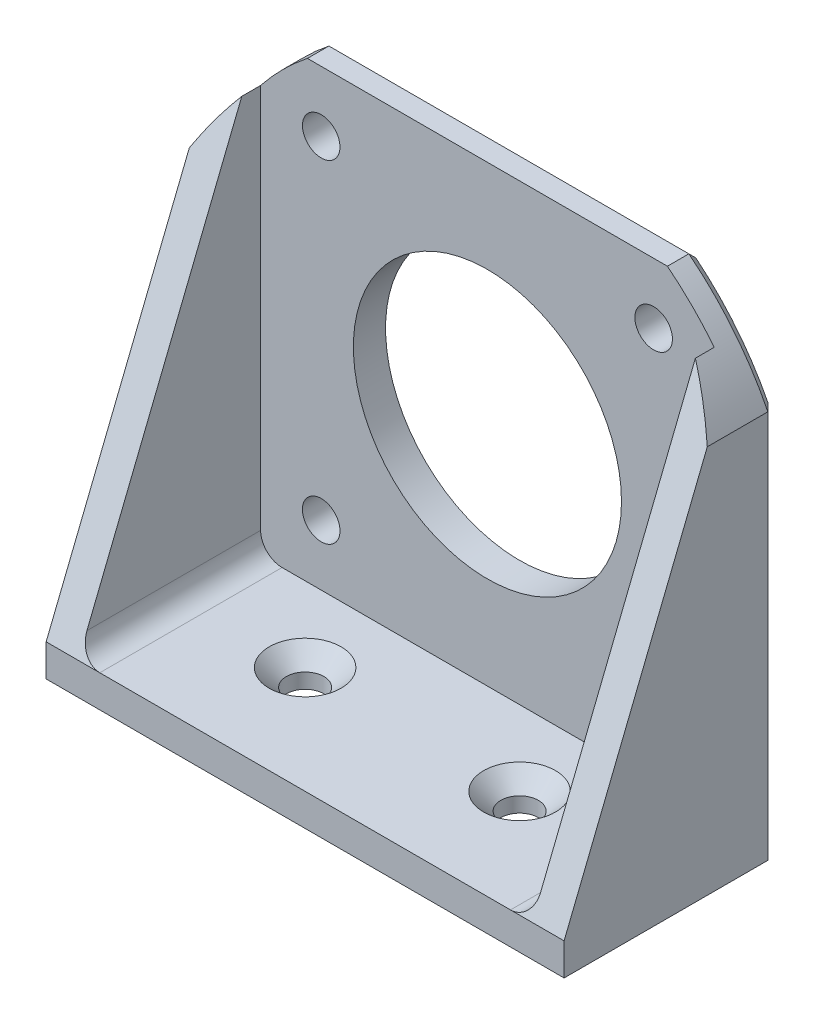
ISO-10303-21;
HEADER;
FILE_DESCRIPTION(('STEP AP214'),'2;1');
FILE_NAME('part.step','',(''),(''),'','','');
FILE_SCHEMA(('AUTOMOTIVE_DESIGN { 1 0 10303 214 1 1 1 1 }'));
ENDSEC;
DATA;
#1=APPLICATION_CONTEXT('core data for automotive mechanical design processes');
#2=APPLICATION_PROTOCOL_DEFINITION('international standard','automotive_design',2000,#1);
#3=PRODUCT_CONTEXT('',#1,'mechanical');
#4=PRODUCT('Part','Part','',(#3));
#5=PRODUCT_RELATED_PRODUCT_CATEGORY('part','',(#4));
#6=PRODUCT_DEFINITION_FORMATION('','',#4);
#7=PRODUCT_DEFINITION_CONTEXT('part definition',#1,'design');
#8=PRODUCT_DEFINITION('design','',#6,#7);
#9=PRODUCT_DEFINITION_SHAPE('','',#8);
#10=(LENGTH_UNIT() NAMED_UNIT(*) SI_UNIT(.MILLI.,.METRE.));
#11=(NAMED_UNIT(*) PLANE_ANGLE_UNIT() SI_UNIT($,.RADIAN.));
#12=(NAMED_UNIT(*) SI_UNIT($,.STERADIAN.) SOLID_ANGLE_UNIT());
#13=UNCERTAINTY_MEASURE_WITH_UNIT(LENGTH_MEASURE(1.E-05),#10,'distance_accuracy_value','');
#14=(GEOMETRIC_REPRESENTATION_CONTEXT(3) GLOBAL_UNCERTAINTY_ASSIGNED_CONTEXT((#13)) GLOBAL_UNIT_ASSIGNED_CONTEXT((#10,
#11,#12)) REPRESENTATION_CONTEXT('',''));
#15=CARTESIAN_POINT('',(0.,0.,0.));
#16=DIRECTION('',(0.,0.,1.));
#17=DIRECTION('',(1.,0.,0.));
#18=AXIS2_PLACEMENT_3D('',#15,#16,#17);
#19=CARTESIAN_POINT('',(-24.15,45.3,-7.00000000000001));
#20=DIRECTION('',(0.,0.,-1.));
#21=DIRECTION('',(-1.,0.,0.));
#22=AXIS2_PLACEMENT_3D('',#19,#20,#21);
#23=PLANE('',#22);
#24=CARTESIAN_POINT('',(-15.5,8.64999999999999,-7.));
#25=DIRECTION('',(0.,0.,1.));
#26=DIRECTION('',(1.,0.,0.));
#27=AXIS2_PLACEMENT_3D('',#24,#25,#26);
#28=CIRCLE('',#27,1.75);
#29=CARTESIAN_POINT('',(-13.75,8.64999999999999,-7.));
#30=VERTEX_POINT('',#29);
#31=EDGE_CURVE('E197',#30,#30,#28,.T.);
#32=ORIENTED_EDGE('',*,*,#31,.F.);
#33=EDGE_LOOP('',(#32));
#34=FACE_BOUND('',#33,.T.);
#35=CARTESIAN_POINT('',(15.5,8.64999999999999,-7.));
#36=DIRECTION('',(0.,0.,1.));
#37=DIRECTION('',(1.,0.,0.));
#38=AXIS2_PLACEMENT_3D('',#35,#36,#37);
#39=CIRCLE('',#38,1.75);
#40=CARTESIAN_POINT('',(17.25,8.64999999999999,-7.));
#41=VERTEX_POINT('',#40);
#42=EDGE_CURVE('E214',#41,#41,#39,.T.);
#43=ORIENTED_EDGE('',*,*,#42,.F.);
#44=EDGE_LOOP('',(#43));
#45=FACE_BOUND('',#44,.T.);
#46=CARTESIAN_POINT('',(15.5,39.65,-7.));
#47=DIRECTION('',(0.,0.,1.));
#48=DIRECTION('',(1.,0.,0.));
#49=AXIS2_PLACEMENT_3D('',#46,#47,#48);
#50=CIRCLE('',#49,1.75);
#51=CARTESIAN_POINT('',(17.25,39.65,-7.));
#52=VERTEX_POINT('',#51);
#53=EDGE_CURVE('E208',#52,#52,#50,.T.);
#54=ORIENTED_EDGE('',*,*,#53,.F.);
#55=EDGE_LOOP('',(#54));
#56=FACE_BOUND('',#55,.T.);
#57=CARTESIAN_POINT('',(-15.5,39.65,-7.));
#58=DIRECTION('',(0.,0.,1.));
#59=DIRECTION('',(1.,0.,0.));
#60=AXIS2_PLACEMENT_3D('',#57,#58,#59);
#61=CIRCLE('',#60,1.75);
#62=CARTESIAN_POINT('',(-13.75,39.65,-7.));
#63=VERTEX_POINT('',#62);
#64=EDGE_CURVE('E202',#63,#63,#61,.T.);
#65=ORIENTED_EDGE('',*,*,#64,.F.);
#66=EDGE_LOOP('',(#65));
#67=FACE_BOUND('',#66,.T.);
#68=CARTESIAN_POINT('',(0.,24.15,-7.));
#69=DIRECTION('',(0.,0.,1.));
#70=DIRECTION('',(1.,0.,0.));
#71=AXIS2_PLACEMENT_3D('',#68,#69,#70);
#72=CIRCLE('',#71,12.5);
#73=CARTESIAN_POINT('',(12.5,24.15,-7.));
#74=VERTEX_POINT('',#73);
#75=EDGE_CURVE('E201',#74,#74,#72,.T.);
#76=ORIENTED_EDGE('',*,*,#75,.F.);
#77=EDGE_LOOP('',(#76));
#78=FACE_BOUND('',#77,.T.);
#79=DIRECTION('',(1.,0.,0.));
#80=VECTOR('',#79,1.);
#81=CARTESIAN_POINT('',(-24.15,3.,-7.00000000000001));
#82=LINE('',#81,#80);
#83=CARTESIAN_POINT('',(-19.15,3.,-7.00000000000001));
#84=VERTEX_POINT('',#83);
#85=CARTESIAN_POINT('',(19.15,3.,-7.));
#86=VERTEX_POINT('',#85);
#87=EDGE_CURVE('E225',#84,#86,#82,.T.);
#88=ORIENTED_EDGE('',*,*,#87,.T.);
#89=CARTESIAN_POINT('',(19.15,5.,-7.));
#90=DIRECTION('',(0.,0.,-1.));
#91=DIRECTION('',(-1.,0.,0.));
#92=AXIS2_PLACEMENT_3D('',#89,#90,#91);
#93=CIRCLE('',#92,2.);
#94=CARTESIAN_POINT('',(21.15,5.,-7.));
#95=VERTEX_POINT('',#94);
#96=EDGE_CURVE('E255',#86,#95,#93,.F.);
#97=ORIENTED_EDGE('',*,*,#96,.T.);
#98=DIRECTION('',(0.,-1.,0.));
#99=VECTOR('',#98,1.);
#100=CARTESIAN_POINT('',(21.15,45.3,-7.));
#101=LINE('',#100,#99);
#102=CARTESIAN_POINT('',(21.15,40.9332505790743,-7.));
#103=VERTEX_POINT('',#102);
#104=EDGE_CURVE('E182',#103,#95,#101,.T.);
#105=ORIENTED_EDGE('',*,*,#104,.F.);
#106=CARTESIAN_POINT('',(0.,24.15,-7.00000000000001));
#107=DIRECTION('',(0.,0.,-1.));
#108=DIRECTION('',(-1.,0.,0.));
#109=AXIS2_PLACEMENT_3D('',#106,#107,#108);
#110=CIRCLE('',#109,27.);
#111=CARTESIAN_POINT('',(16.7832505790744,45.3,-7.00000000000001));
#112=VERTEX_POINT('',#111);
#113=EDGE_CURVE('E158',#103,#112,#110,.F.);
#114=ORIENTED_EDGE('',*,*,#113,.T.);
#115=DIRECTION('',(1.,0.,0.));
#116=VECTOR('',#115,1.);
#117=CARTESIAN_POINT('',(-24.15,45.3,-7.00000000000001));
#118=LINE('',#117,#116);
#119=CARTESIAN_POINT('',(-16.7832505790744,45.3,-7.00000000000001));
#120=VERTEX_POINT('',#119);
#121=EDGE_CURVE('E228',#120,#112,#118,.T.);
#122=ORIENTED_EDGE('',*,*,#121,.F.);
#123=CARTESIAN_POINT('',(-21.15,40.9332505790744,-7.));
#124=VERTEX_POINT('',#123);
#125=EDGE_CURVE('E184',#120,#124,#110,.F.);
#126=ORIENTED_EDGE('',*,*,#125,.T.);
#127=DIRECTION('',(0.,1.,0.));
#128=VECTOR('',#127,1.);
#129=CARTESIAN_POINT('',(-21.15,45.3,-7.00000000000001));
#130=LINE('',#129,#128);
#131=CARTESIAN_POINT('',(-21.15,5.,-7.00000000000001));
#132=VERTEX_POINT('',#131);
#133=EDGE_CURVE('E193',#132,#124,#130,.T.);
#134=ORIENTED_EDGE('',*,*,#133,.F.);
#135=CARTESIAN_POINT('',(-19.15,5.,-7.00000000000001));
#136=DIRECTION('',(0.,0.,-1.));
#137=DIRECTION('',(-1.,0.,0.));
#138=AXIS2_PLACEMENT_3D('',#135,#136,#137);
#139=CIRCLE('',#138,2.);
#140=EDGE_CURVE('E253',#132,#84,#139,.F.);
#141=ORIENTED_EDGE('',*,*,#140,.T.);
#142=EDGE_LOOP('',(#88,#97,#105,#114,#122,#126,#134,#141));
#143=FACE_BOUND('',#142,.T.);
#144=ADVANCED_FACE('F35',(#34,#45,#56,#67,#78,#143),#23,.F.);
#145=CARTESIAN_POINT('',(0.,3.,0.));
#146=DIRECTION('',(0.,1.,0.));
#147=DIRECTION('',(0.,0.,1.));
#148=AXIS2_PLACEMENT_3D('',#145,#146,#147);
#149=PLANE('',#148);
#150=CARTESIAN_POINT('',(10.,3.,0.));
#151=DIRECTION('',(0.,1.,0.));
#152=DIRECTION('',(0.,0.,1.));
#153=AXIS2_PLACEMENT_3D('',#150,#151,#152);
#154=CIRCLE('',#153,3.35000000000001);
#155=CARTESIAN_POINT('',(10.,3.,3.35000000000001));
#156=VERTEX_POINT('',#155);
#157=EDGE_CURVE('E44',#156,#156,#154,.F.);
#158=ORIENTED_EDGE('',*,*,#157,.T.);
#159=EDGE_LOOP('',(#158));
#160=FACE_BOUND('',#159,.T.);
#161=CARTESIAN_POINT('',(-10.,3.,0.));
#162=DIRECTION('',(0.,1.,0.));
#163=DIRECTION('',(0.,0.,1.));
#164=AXIS2_PLACEMENT_3D('',#161,#162,#163);
#165=CIRCLE('',#164,3.35000000000001);
#166=CARTESIAN_POINT('',(-10.,3.,3.35000000000001));
#167=VERTEX_POINT('',#166);
#168=EDGE_CURVE('E731',#167,#167,#165,.F.);
#169=ORIENTED_EDGE('',*,*,#168,.T.);
#170=EDGE_LOOP('',(#169));
#171=FACE_BOUND('',#170,.T.);
#172=DIRECTION('',(1.,0.,0.));
#173=VECTOR('',#172,1.);
#174=CARTESIAN_POINT('',(-24.15,3.,9.99999999999999));
#175=LINE('',#174,#173);
#176=CARTESIAN_POINT('',(-19.15,3.,9.99999999999999));
#177=VERTEX_POINT('',#176);
#178=CARTESIAN_POINT('',(19.15,3.,9.99999999999999));
#179=VERTEX_POINT('',#178);
#180=EDGE_CURVE('E237',#177,#179,#175,.T.);
#181=ORIENTED_EDGE('',*,*,#180,.T.);
#182=DIRECTION('',(0.,0.,-1.));
#183=VECTOR('',#182,1.);
#184=CARTESIAN_POINT('',(19.15,3.,0.));
#185=LINE('',#184,#183);
#186=EDGE_CURVE('E250',#179,#86,#185,.T.);
#187=ORIENTED_EDGE('',*,*,#186,.T.);
#188=ORIENTED_EDGE('',*,*,#87,.F.);
#189=DIRECTION('',(0.,0.,1.));
#190=VECTOR('',#189,1.);
#191=CARTESIAN_POINT('',(-19.15,3.,0.));
#192=LINE('',#191,#190);
#193=EDGE_CURVE('E163',#84,#177,#192,.T.);
#194=ORIENTED_EDGE('',*,*,#193,.T.);
#195=EDGE_LOOP('',(#181,#187,#188,#194));
#196=FACE_BOUND('',#195,.T.);
#197=ADVANCED_FACE('F368',(#160,#171,#196),#149,.T.);
#198=CARTESIAN_POINT('',(24.15,3.,-10.));
#199=DIRECTION('',(-1.,0.,0.));
#200=DIRECTION('',(0.,0.,1.));
#201=AXIS2_PLACEMENT_3D('',#198,#199,#200);
#202=PLANE('',#201);
#203=DIRECTION('',(0.,0.,-1.));
#204=VECTOR('',#203,1.);
#205=CARTESIAN_POINT('',(24.15,0.,-10.));
#206=LINE('',#205,#204);
#207=CARTESIAN_POINT('',(24.15,0.,9.99999999999999));
#208=VERTEX_POINT('',#207);
#209=CARTESIAN_POINT('',(24.15,0.,-9.00000000000001));
#210=VERTEX_POINT('',#209);
#211=EDGE_CURVE('E231',#208,#210,#206,.T.);
#212=ORIENTED_EDGE('',*,*,#211,.T.);
#213=DIRECTION('',(0.,1.,0.));
#214=VECTOR('',#213,1.);
#215=CARTESIAN_POINT('',(24.15,3.,-9.00000000000001));
#216=LINE('',#215,#214);
#217=CARTESIAN_POINT('',(24.15,36.2238353475604,-9.00000000000001));
#218=VERTEX_POINT('',#217);
#219=EDGE_CURVE('E280',#210,#218,#216,.T.);
#220=ORIENTED_EDGE('',*,*,#219,.T.);
#221=DIRECTION('',(0.,0.,-1.));
#222=VECTOR('',#221,1.);
#223=CARTESIAN_POINT('',(24.15,36.2238353475604,9.99999999999999));
#224=LINE('',#223,#222);
#225=CARTESIAN_POINT('',(24.15,36.2238353475604,-3.35236881580443));
#226=VERTEX_POINT('',#225);
#227=EDGE_CURVE('E174',#218,#226,#224,.F.);
#228=ORIENTED_EDGE('',*,*,#227,.T.);
#229=DIRECTION('',(0.,-0.927870342081396,0.372902974358953));
#230=VECTOR('',#229,1.);
#231=CARTESIAN_POINT('',(24.15,45.3,-7.00000000000001));
#232=LINE('',#231,#230);
#233=CARTESIAN_POINT('',(24.15,3.00000000000002,9.99999999999999));
#234=VERTEX_POINT('',#233);
#235=EDGE_CURVE('E173',#226,#234,#232,.T.);
#236=ORIENTED_EDGE('',*,*,#235,.T.);
#237=DIRECTION('',(0.,-1.,0.));
#238=VECTOR('',#237,1.);
#239=CARTESIAN_POINT('',(24.15,3.,9.99999999999999));
#240=LINE('',#239,#238);
#241=EDGE_CURVE('E236',#234,#208,#240,.T.);
#242=ORIENTED_EDGE('',*,*,#241,.T.);
#243=EDGE_LOOP('',(#212,#220,#228,#236,#242));
#244=FACE_BOUND('',#243,.T.);
#245=ADVANCED_FACE('F375',(#244),#202,.F.);
#246=CARTESIAN_POINT('',(-24.15,3.,-10.));
#247=DIRECTION('',(0.,0.,1.));
#248=DIRECTION('',(1.,0.,0.));
#249=AXIS2_PLACEMENT_3D('',#246,#247,#248);
#250=PLANE('',#249);
#251=DIRECTION('',(0.,-1.,0.));
#252=VECTOR('',#251,1.);
#253=CARTESIAN_POINT('',(23.15,3.,-10.));
#254=LINE('',#253,#252);
#255=CARTESIAN_POINT('',(23.15,35.9854340858289,-10.));
#256=VERTEX_POINT('',#255);
#257=CARTESIAN_POINT('',(23.15,1.00000000000001,-10.));
#258=VERTEX_POINT('',#257);
#259=EDGE_CURVE('E272',#256,#258,#254,.T.);
#260=ORIENTED_EDGE('',*,*,#259,.T.);
#261=DIRECTION('',(-1.,0.,0.));
#262=VECTOR('',#261,1.);
#263=CARTESIAN_POINT('',(-24.15,1.00000000000001,-10.));
#264=LINE('',#263,#262);
#265=CARTESIAN_POINT('',(-23.15,1.00000000000001,-10.));
#266=VERTEX_POINT('',#265);
#267=EDGE_CURVE('E274',#258,#266,#264,.T.);
#268=ORIENTED_EDGE('',*,*,#267,.T.);
#269=DIRECTION('',(0.,1.,0.));
#270=VECTOR('',#269,1.);
#271=CARTESIAN_POINT('',(-23.15,3.,-10.));
#272=LINE('',#271,#270);
#273=CARTESIAN_POINT('',(-23.15,35.9854340858289,-10.));
#274=VERTEX_POINT('',#273);
#275=EDGE_CURVE('E264',#266,#274,#272,.T.);
#276=ORIENTED_EDGE('',*,*,#275,.T.);
#277=CARTESIAN_POINT('',(0.,24.15,-10.));
#278=DIRECTION('',(0.,0.,1.));
#279=DIRECTION('',(1.,0.,0.));
#280=AXIS2_PLACEMENT_3D('',#277,#278,#279);
#281=CIRCLE('',#280,26.);
#282=CARTESIAN_POINT('',(-16.4309920576939,44.3,-10.));
#283=VERTEX_POINT('',#282);
#284=EDGE_CURVE('E266',#274,#283,#281,.F.);
#285=ORIENTED_EDGE('',*,*,#284,.T.);
#286=DIRECTION('',(1.,0.,0.));
#287=VECTOR('',#286,1.);
#288=CARTESIAN_POINT('',(16.7832505790744,44.3,-10.));
#289=LINE('',#288,#287);
#290=CARTESIAN_POINT('',(16.4309920576939,44.3,-10.));
#291=VERTEX_POINT('',#290);
#292=EDGE_CURVE('E268',#283,#291,#289,.T.);
#293=ORIENTED_EDGE('',*,*,#292,.T.);
#294=CARTESIAN_POINT('',(0.,24.15,-10.));
#295=DIRECTION('',(0.,0.,1.));
#296=DIRECTION('',(1.,0.,0.));
#297=AXIS2_PLACEMENT_3D('',#294,#295,#296);
#298=CIRCLE('',#297,26.);
#299=EDGE_CURVE('E270',#291,#256,#298,.F.);
#300=ORIENTED_EDGE('',*,*,#299,.T.);
#301=EDGE_LOOP('',(#260,#268,#276,#285,#293,#300));
#302=FACE_BOUND('',#301,.T.);
#303=CARTESIAN_POINT('',(-15.5,8.64999999999999,-10.));
#304=DIRECTION('',(0.,0.,1.));
#305=DIRECTION('',(1.,0.,0.));
#306=AXIS2_PLACEMENT_3D('',#303,#304,#305);
#307=CIRCLE('',#306,1.75);
#308=CARTESIAN_POINT('',(-13.75,8.64999999999999,-10.));
#309=VERTEX_POINT('',#308);
#310=EDGE_CURVE('E217',#309,#309,#307,.T.);
#311=ORIENTED_EDGE('',*,*,#310,.T.);
#312=EDGE_LOOP('',(#311));
#313=FACE_BOUND('',#312,.T.);
#314=CARTESIAN_POINT('',(15.5,8.64999999999999,-10.));
#315=DIRECTION('',(0.,0.,1.));
#316=DIRECTION('',(1.,0.,0.));
#317=AXIS2_PLACEMENT_3D('',#314,#315,#316);
#318=CIRCLE('',#317,1.75);
#319=CARTESIAN_POINT('',(17.25,8.64999999999999,-10.));
#320=VERTEX_POINT('',#319);
#321=EDGE_CURVE('E211',#320,#320,#318,.T.);
#322=ORIENTED_EDGE('',*,*,#321,.T.);
#323=EDGE_LOOP('',(#322));
#324=FACE_BOUND('',#323,.T.);
#325=CARTESIAN_POINT('',(15.5,39.65,-10.));
#326=DIRECTION('',(0.,0.,1.));
#327=DIRECTION('',(1.,0.,0.));
#328=AXIS2_PLACEMENT_3D('',#325,#326,#327);
#329=CIRCLE('',#328,1.75);
#330=CARTESIAN_POINT('',(17.25,39.65,-10.));
#331=VERTEX_POINT('',#330);
#332=EDGE_CURVE('E205',#331,#331,#329,.T.);
#333=ORIENTED_EDGE('',*,*,#332,.T.);
#334=EDGE_LOOP('',(#333));
#335=FACE_BOUND('',#334,.T.);
#336=CARTESIAN_POINT('',(-15.5,39.65,-10.));
#337=DIRECTION('',(0.,0.,1.));
#338=DIRECTION('',(1.,0.,0.));
#339=AXIS2_PLACEMENT_3D('',#336,#337,#338);
#340=CIRCLE('',#339,1.75);
#341=CARTESIAN_POINT('',(-13.75,39.65,-10.));
#342=VERTEX_POINT('',#341);
#343=EDGE_CURVE('E198',#342,#342,#340,.T.);
#344=ORIENTED_EDGE('',*,*,#343,.T.);
#345=EDGE_LOOP('',(#344));
#346=FACE_BOUND('',#345,.T.);
#347=CARTESIAN_POINT('',(0.,24.15,-10.));
#348=DIRECTION('',(0.,0.,1.));
#349=DIRECTION('',(1.,0.,0.));
#350=AXIS2_PLACEMENT_3D('',#347,#348,#349);
#351=CIRCLE('',#350,12.5);
#352=CARTESIAN_POINT('',(12.5,24.15,-10.));
#353=VERTEX_POINT('',#352);
#354=EDGE_CURVE('E222',#353,#353,#351,.T.);
#355=ORIENTED_EDGE('',*,*,#354,.T.);
#356=EDGE_LOOP('',(#355));
#357=FACE_BOUND('',#356,.T.);
#358=ADVANCED_FACE('F395',(#302,#313,#324,#335,#346,#357),#250,.F.);
#359=CARTESIAN_POINT('',(-24.15,3.,-10.));
#360=DIRECTION('',(1.,0.,0.));
#361=DIRECTION('',(0.,0.,-1.));
#362=AXIS2_PLACEMENT_3D('',#359,#360,#361);
#363=PLANE('',#362);
#364=DIRECTION('',(0.,0.,-1.));
#365=VECTOR('',#364,1.);
#366=CARTESIAN_POINT('',(-24.15,36.2238353475605,9.99999999999999));
#367=LINE('',#366,#365);
#368=CARTESIAN_POINT('',(-24.15,36.2238353475605,-3.35236881580445));
#369=VERTEX_POINT('',#368);
#370=CARTESIAN_POINT('',(-24.15,36.2238353475605,-9.00000000000001));
#371=VERTEX_POINT('',#370);
#372=EDGE_CURVE('E446',#369,#371,#367,.T.);
#373=ORIENTED_EDGE('',*,*,#372,.T.);
#374=DIRECTION('',(0.,-1.,0.));
#375=VECTOR('',#374,1.);
#376=CARTESIAN_POINT('',(-24.15,3.,-9.00000000000001));
#377=LINE('',#376,#375);
#378=CARTESIAN_POINT('',(-24.15,0.,-9.00000000000001));
#379=VERTEX_POINT('',#378);
#380=EDGE_CURVE('E286',#371,#379,#377,.T.);
#381=ORIENTED_EDGE('',*,*,#380,.T.);
#382=DIRECTION('',(0.,0.,1.));
#383=VECTOR('',#382,1.);
#384=CARTESIAN_POINT('',(-24.15,0.,-10.));
#385=LINE('',#384,#383);
#386=CARTESIAN_POINT('',(-24.15,0.,9.99999999999999));
#387=VERTEX_POINT('',#386);
#388=EDGE_CURVE('E240',#379,#387,#385,.T.);
#389=ORIENTED_EDGE('',*,*,#388,.T.);
#390=DIRECTION('',(0.,-1.,0.));
#391=VECTOR('',#390,1.);
#392=CARTESIAN_POINT('',(-24.15,3.,9.99999999999999));
#393=LINE('',#392,#391);
#394=CARTESIAN_POINT('',(-24.15,3.,9.99999999999999));
#395=VERTEX_POINT('',#394);
#396=EDGE_CURVE('E164',#395,#387,#393,.T.);
#397=ORIENTED_EDGE('',*,*,#396,.F.);
#398=DIRECTION('',(0.,-0.927870342081396,0.372902974358953));
#399=VECTOR('',#398,1.);
#400=CARTESIAN_POINT('',(-24.15,45.3,-7.00000000000001));
#401=LINE('',#400,#399);
#402=EDGE_CURVE('E191',#369,#395,#401,.T.);
#403=ORIENTED_EDGE('',*,*,#402,.F.);
#404=EDGE_LOOP('',(#373,#381,#389,#397,#403));
#405=FACE_BOUND('',#404,.T.);
#406=ADVANCED_FACE('F391',(#405),#363,.F.);
#407=CARTESIAN_POINT('',(-24.15,3.,9.99999999999999));
#408=DIRECTION('',(0.,0.,-1.));
#409=DIRECTION('',(-1.,0.,0.));
#410=AXIS2_PLACEMENT_3D('',#407,#408,#409);
#411=PLANE('',#410);
#412=DIRECTION('',(1.,0.,0.));
#413=VECTOR('',#412,1.);
#414=CARTESIAN_POINT('',(-24.15,3.,9.99999999999999));
#415=LINE('',#414,#413);
#416=EDGE_CURVE('E188',#179,#234,#415,.T.);
#417=ORIENTED_EDGE('',*,*,#416,.F.);
#418=ORIENTED_EDGE('',*,*,#180,.F.);
#419=EDGE_CURVE('E234',#395,#177,#175,.T.);
#420=ORIENTED_EDGE('',*,*,#419,.F.);
#421=ORIENTED_EDGE('',*,*,#396,.T.);
#422=DIRECTION('',(1.,0.,0.));
#423=VECTOR('',#422,1.);
#424=CARTESIAN_POINT('',(-24.15,0.,9.99999999999999));
#425=LINE('',#424,#423);
#426=EDGE_CURVE('E242',#387,#208,#425,.T.);
#427=ORIENTED_EDGE('',*,*,#426,.T.);
#428=ORIENTED_EDGE('',*,*,#241,.F.);
#429=EDGE_LOOP('',(#417,#418,#420,#421,#427,#428));
#430=FACE_BOUND('',#429,.T.);
#431=ADVANCED_FACE('F387',(#430),#411,.F.);
#432=CARTESIAN_POINT('',(0.,0.,0.));
#433=DIRECTION('',(0.,1.,0.));
#434=DIRECTION('',(0.,0.,1.));
#435=AXIS2_PLACEMENT_3D('',#432,#433,#434);
#436=PLANE('',#435);
#437=CARTESIAN_POINT('',(-10.,0.,0.));
#438=DIRECTION('',(0.,1.,0.));
#439=DIRECTION('',(0.,0.,1.));
#440=AXIS2_PLACEMENT_3D('',#437,#438,#439);
#441=CIRCLE('',#440,1.75);
#442=CARTESIAN_POINT('',(-10.,0.,1.75));
#443=VERTEX_POINT('',#442);
#444=EDGE_CURVE('E175',#443,#443,#441,.T.);
#445=ORIENTED_EDGE('',*,*,#444,.T.);
#446=EDGE_LOOP('',(#445));
#447=FACE_BOUND('',#446,.T.);
#448=CARTESIAN_POINT('',(10.,0.,0.));
#449=DIRECTION('',(0.,1.,0.));
#450=DIRECTION('',(0.,0.,1.));
#451=AXIS2_PLACEMENT_3D('',#448,#449,#450);
#452=CIRCLE('',#451,1.75);
#453=CARTESIAN_POINT('',(10.,0.,1.75));
#454=VERTEX_POINT('',#453);
#455=EDGE_CURVE('E462',#454,#454,#452,.T.);
#456=ORIENTED_EDGE('',*,*,#455,.T.);
#457=EDGE_LOOP('',(#456));
#458=FACE_BOUND('',#457,.T.);
#459=ORIENTED_EDGE('',*,*,#388,.F.);
#460=DIRECTION('',(1.,0.,0.));
#461=VECTOR('',#460,1.);
#462=CARTESIAN_POINT('',(0.,0.,-9.00000000000001));
#463=LINE('',#462,#461);
#464=EDGE_CURVE('E277',#379,#210,#463,.T.);
#465=ORIENTED_EDGE('',*,*,#464,.T.);
#466=ORIENTED_EDGE('',*,*,#211,.F.);
#467=ORIENTED_EDGE('',*,*,#426,.F.);
#468=EDGE_LOOP('',(#459,#465,#466,#467));
#469=FACE_BOUND('',#468,.T.);
#470=ADVANCED_FACE('F384',(#447,#458,#469),#436,.F.);
#471=CARTESIAN_POINT('',(0.,45.3,0.));
#472=DIRECTION('',(0.,1.,0.));
#473=DIRECTION('',(0.,0.,1.));
#474=AXIS2_PLACEMENT_3D('',#471,#472,#473);
#475=PLANE('',#474);
#476=DIRECTION('',(0.,0.,-1.));
#477=VECTOR('',#476,1.);
#478=CARTESIAN_POINT('',(16.7832505790744,45.3,9.99999999999999));
#479=LINE('',#478,#477);
#480=CARTESIAN_POINT('',(16.7832505790744,45.3,-9.00000000000001));
#481=VERTEX_POINT('',#480);
#482=EDGE_CURVE('E429',#481,#112,#479,.F.);
#483=ORIENTED_EDGE('',*,*,#482,.F.);
#484=DIRECTION('',(-1.,0.,0.));
#485=VECTOR('',#484,1.);
#486=CARTESIAN_POINT('',(-16.7832505790744,45.3,-9.00000000000001));
#487=LINE('',#486,#485);
#488=CARTESIAN_POINT('',(-16.7832505790744,45.3,-9.00000000000001));
#489=VERTEX_POINT('',#488);
#490=EDGE_CURVE('E59',#481,#489,#487,.T.);
#491=ORIENTED_EDGE('',*,*,#490,.T.);
#492=DIRECTION('',(0.,0.,-1.));
#493=VECTOR('',#492,1.);
#494=CARTESIAN_POINT('',(-16.7832505790744,45.3,9.99999999999999));
#495=LINE('',#494,#493);
#496=EDGE_CURVE('E180',#120,#489,#495,.T.);
#497=ORIENTED_EDGE('',*,*,#496,.F.);
#498=ORIENTED_EDGE('',*,*,#121,.T.);
#499=EDGE_LOOP('',(#483,#491,#497,#498));
#500=FACE_BOUND('',#499,.T.);
#501=ADVANCED_FACE('F381',(#500),#475,.T.);
#502=CARTESIAN_POINT('',(0.,24.15,-10.));
#503=DIRECTION('',(0.,0.,1.));
#504=DIRECTION('',(1.,0.,0.));
#505=AXIS2_PLACEMENT_3D('',#502,#503,#504);
#506=CYLINDRICAL_SURFACE('',#505,12.5);
#507=ORIENTED_EDGE('',*,*,#354,.F.);
#508=EDGE_LOOP('',(#507));
#509=FACE_BOUND('',#508,.T.);
#510=ORIENTED_EDGE('',*,*,#75,.T.);
#511=EDGE_LOOP('',(#510));
#512=FACE_BOUND('',#511,.T.);
#513=ADVANCED_FACE('F501',(#509,#512),#506,.F.);
#514=CARTESIAN_POINT('',(-15.5,39.65,-10.));
#515=DIRECTION('',(0.,0.,1.));
#516=DIRECTION('',(1.,0.,0.));
#517=AXIS2_PLACEMENT_3D('',#514,#515,#516);
#518=CYLINDRICAL_SURFACE('',#517,1.75);
#519=ORIENTED_EDGE('',*,*,#343,.F.);
#520=EDGE_LOOP('',(#519));
#521=FACE_BOUND('',#520,.T.);
#522=ORIENTED_EDGE('',*,*,#64,.T.);
#523=EDGE_LOOP('',(#522));
#524=FACE_BOUND('',#523,.T.);
#525=ADVANCED_FACE('F497',(#521,#524),#518,.F.);
#526=CARTESIAN_POINT('',(15.5,39.65,-10.));
#527=DIRECTION('',(0.,0.,1.));
#528=DIRECTION('',(1.,0.,0.));
#529=AXIS2_PLACEMENT_3D('',#526,#527,#528);
#530=CYLINDRICAL_SURFACE('',#529,1.75);
#531=ORIENTED_EDGE('',*,*,#332,.F.);
#532=EDGE_LOOP('',(#531));
#533=FACE_BOUND('',#532,.T.);
#534=ORIENTED_EDGE('',*,*,#53,.T.);
#535=EDGE_LOOP('',(#534));
#536=FACE_BOUND('',#535,.T.);
#537=ADVANCED_FACE('F500',(#533,#536),#530,.F.);
#538=CARTESIAN_POINT('',(15.5,8.64999999999999,-10.));
#539=DIRECTION('',(0.,0.,1.));
#540=DIRECTION('',(1.,0.,0.));
#541=AXIS2_PLACEMENT_3D('',#538,#539,#540);
#542=CYLINDRICAL_SURFACE('',#541,1.75);
#543=ORIENTED_EDGE('',*,*,#321,.F.);
#544=EDGE_LOOP('',(#543));
#545=FACE_BOUND('',#544,.T.);
#546=ORIENTED_EDGE('',*,*,#42,.T.);
#547=EDGE_LOOP('',(#546));
#548=FACE_BOUND('',#547,.T.);
#549=ADVANCED_FACE('F492',(#545,#548),#542,.F.);
#550=CARTESIAN_POINT('',(-15.5,8.64999999999999,-10.));
#551=DIRECTION('',(0.,0.,1.));
#552=DIRECTION('',(1.,0.,0.));
#553=AXIS2_PLACEMENT_3D('',#550,#551,#552);
#554=CYLINDRICAL_SURFACE('',#553,1.75);
#555=ORIENTED_EDGE('',*,*,#310,.F.);
#556=EDGE_LOOP('',(#555));
#557=FACE_BOUND('',#556,.T.);
#558=ORIENTED_EDGE('',*,*,#31,.T.);
#559=EDGE_LOOP('',(#558));
#560=FACE_BOUND('',#559,.T.);
#561=ADVANCED_FACE('F485',(#557,#560),#554,.F.);
#562=CARTESIAN_POINT('',(-24.15,45.3,-7.00000000000001));
#563=DIRECTION('',(0.,-0.372902974358953,-0.927870342081396));
#564=DIRECTION('',(0.,-0.927870342081396,0.372902974358953));
#565=AXIS2_PLACEMENT_3D('',#562,#563,#564);
#566=PLANE('',#565);
#567=CARTESIAN_POINT('',(0.,24.15,1.49999999999999));
#568=DIRECTION('',(0.,-0.372902974358953,-0.927870342081396));
#569=DIRECTION('',(0.,0.927870342081396,-0.372902974358953));
#570=AXIS2_PLACEMENT_3D('',#567,#568,#569);
#571=ELLIPSE('',#570,29.0988932132842,27.);
#572=CARTESIAN_POINT('',(-21.15,40.9332505790744,-5.24504160388332));
#573=VERTEX_POINT('',#572);
#574=EDGE_CURVE('E474',#369,#573,#571,.T.);
#575=ORIENTED_EDGE('',*,*,#574,.F.);
#576=ORIENTED_EDGE('',*,*,#402,.T.);
#577=ORIENTED_EDGE('',*,*,#419,.T.);
#578=CARTESIAN_POINT('',(-19.15,5.,9.19621749408983));
#579=DIRECTION('',(0.,-0.372902974358953,-0.927870342081396));
#580=DIRECTION('',(0.,-0.927870342081396,0.372902974358953));
#581=AXIS2_PLACEMENT_3D('',#578,#579,#580);
#582=ELLIPSE('',#581,2.15547357135438,2.);
#583=CARTESIAN_POINT('',(-21.15,4.99999999999999,9.19621749408983));
#584=VERTEX_POINT('',#583);
#585=EDGE_CURVE('E262',#177,#584,#582,.T.);
#586=ORIENTED_EDGE('',*,*,#585,.T.);
#587=DIRECTION('',(0.,-0.927870342081396,0.372902974358953));
#588=VECTOR('',#587,1.);
#589=CARTESIAN_POINT('',(-21.15,45.3,-7.00000000000001));
#590=LINE('',#589,#588);
#591=EDGE_CURVE('E190',#573,#584,#590,.T.);
#592=ORIENTED_EDGE('',*,*,#591,.F.);
#593=EDGE_LOOP('',(#575,#576,#577,#586,#592));
#594=FACE_BOUND('',#593,.T.);
#595=ADVANCED_FACE('F481',(#594),#566,.F.);
#596=CARTESIAN_POINT('',(-21.15,22.65,0.));
#597=DIRECTION('',(-1.,0.,0.));
#598=DIRECTION('',(0.,0.,1.));
#599=AXIS2_PLACEMENT_3D('',#596,#597,#598);
#600=PLANE('',#599);
#601=ORIENTED_EDGE('',*,*,#591,.T.);
#602=DIRECTION('',(0.,0.,1.));
#603=VECTOR('',#602,1.);
#604=CARTESIAN_POINT('',(-21.15,5.,0.));
#605=LINE('',#604,#603);
#606=EDGE_CURVE('E258',#584,#132,#605,.F.);
#607=ORIENTED_EDGE('',*,*,#606,.T.);
#608=ORIENTED_EDGE('',*,*,#133,.T.);
#609=DIRECTION('',(0.,0.,-1.));
#610=VECTOR('',#609,1.);
#611=CARTESIAN_POINT('',(-21.15,40.9332505790744,9.99999999999999));
#612=LINE('',#611,#610);
#613=EDGE_CURVE('E471',#124,#573,#612,.F.);
#614=ORIENTED_EDGE('',*,*,#613,.T.);
#615=EDGE_LOOP('',(#601,#607,#608,#614));
#616=FACE_BOUND('',#615,.T.);
#617=ADVANCED_FACE('F480',(#616),#600,.F.);
#618=CARTESIAN_POINT('',(24.15,45.3,-7.00000000000001));
#619=DIRECTION('',(0.,0.372902974358953,0.927870342081396));
#620=DIRECTION('',(0.,-0.927870342081396,0.372902974358953));
#621=AXIS2_PLACEMENT_3D('',#618,#619,#620);
#622=PLANE('',#621);
#623=CARTESIAN_POINT('',(0.,24.15,1.49999999999999));
#624=DIRECTION('',(0.,0.372902974358953,0.927870342081396));
#625=DIRECTION('',(0.,0.927870342081396,-0.372902974358953));
#626=AXIS2_PLACEMENT_3D('',#623,#624,#625);
#627=ELLIPSE('',#626,29.0988932132842,27.);
#628=CARTESIAN_POINT('',(21.15,40.9332505790743,-5.24504160388331));
#629=VERTEX_POINT('',#628);
#630=EDGE_CURVE('E155',#629,#226,#627,.F.);
#631=ORIENTED_EDGE('',*,*,#630,.F.);
#632=DIRECTION('',(0.,-0.927870342081396,0.372902974358953));
#633=VECTOR('',#632,1.);
#634=CARTESIAN_POINT('',(21.15,45.3,-7.00000000000001));
#635=LINE('',#634,#633);
#636=CARTESIAN_POINT('',(21.15,4.99999999999999,9.19621749408983));
#637=VERTEX_POINT('',#636);
#638=EDGE_CURVE('E170',#629,#637,#635,.T.);
#639=ORIENTED_EDGE('',*,*,#638,.T.);
#640=CARTESIAN_POINT('',(19.15,5.,9.19621749408983));
#641=DIRECTION('',(0.,0.372902974358953,0.927870342081396));
#642=DIRECTION('',(0.,0.927870342081396,-0.372902974358953));
#643=AXIS2_PLACEMENT_3D('',#640,#641,#642);
#644=ELLIPSE('',#643,2.15547357135438,2.);
#645=EDGE_CURVE('E260',#637,#179,#644,.F.);
#646=ORIENTED_EDGE('',*,*,#645,.T.);
#647=ORIENTED_EDGE('',*,*,#416,.T.);
#648=ORIENTED_EDGE('',*,*,#235,.F.);
#649=EDGE_LOOP('',(#631,#639,#646,#647,#648));
#650=FACE_BOUND('',#649,.T.);
#651=ADVANCED_FACE('F168',(#650),#622,.T.);
#652=CARTESIAN_POINT('',(21.15,22.65,0.));
#653=DIRECTION('',(1.,0.,0.));
#654=DIRECTION('',(0.,0.,-1.));
#655=AXIS2_PLACEMENT_3D('',#652,#653,#654);
#656=PLANE('',#655);
#657=ORIENTED_EDGE('',*,*,#104,.T.);
#658=DIRECTION('',(0.,0.,-1.));
#659=VECTOR('',#658,1.);
#660=CARTESIAN_POINT('',(21.15,5.,0.));
#661=LINE('',#660,#659);
#662=EDGE_CURVE('E179',#95,#637,#661,.F.);
#663=ORIENTED_EDGE('',*,*,#662,.T.);
#664=ORIENTED_EDGE('',*,*,#638,.F.);
#665=DIRECTION('',(0.,0.,-1.));
#666=VECTOR('',#665,1.);
#667=CARTESIAN_POINT('',(21.15,40.9332505790743,9.99999999999999));
#668=LINE('',#667,#666);
#669=EDGE_CURVE('E151',#629,#103,#668,.T.);
#670=ORIENTED_EDGE('',*,*,#669,.T.);
#671=EDGE_LOOP('',(#657,#663,#664,#670));
#672=FACE_BOUND('',#671,.T.);
#673=ADVANCED_FACE('F177',(#672),#656,.F.);
#674=CARTESIAN_POINT('',(0.,24.15,9.99999999999999));
#675=DIRECTION('',(0.,0.,-1.));
#676=DIRECTION('',(-1.,0.,0.));
#677=AXIS2_PLACEMENT_3D('',#674,#675,#676);
#678=CYLINDRICAL_SURFACE('',#677,27.);
#679=ORIENTED_EDGE('',*,*,#227,.F.);
#680=CARTESIAN_POINT('',(0.,24.15,-9.00000000000001));
#681=DIRECTION('',(0.,0.,1.));
#682=DIRECTION('',(1.,0.,0.));
#683=AXIS2_PLACEMENT_3D('',#680,#681,#682);
#684=CIRCLE('',#683,27.);
#685=EDGE_CURVE('E282',#218,#481,#684,.T.);
#686=ORIENTED_EDGE('',*,*,#685,.T.);
#687=ORIENTED_EDGE('',*,*,#482,.T.);
#688=ORIENTED_EDGE('',*,*,#113,.F.);
#689=ORIENTED_EDGE('',*,*,#669,.F.);
#690=ORIENTED_EDGE('',*,*,#630,.T.);
#691=EDGE_LOOP('',(#679,#686,#687,#688,#689,#690));
#692=FACE_BOUND('',#691,.T.);
#693=ADVANCED_FACE('F154',(#692),#678,.T.);
#694=ORIENTED_EDGE('',*,*,#496,.T.);
#695=CARTESIAN_POINT('',(0.,24.15,-9.00000000000001));
#696=DIRECTION('',(0.,0.,1.));
#697=DIRECTION('',(1.,0.,0.));
#698=AXIS2_PLACEMENT_3D('',#695,#696,#697);
#699=CIRCLE('',#698,27.);
#700=EDGE_CURVE('E51',#489,#371,#699,.T.);
#701=ORIENTED_EDGE('',*,*,#700,.T.);
#702=ORIENTED_EDGE('',*,*,#372,.F.);
#703=ORIENTED_EDGE('',*,*,#574,.T.);
#704=ORIENTED_EDGE('',*,*,#613,.F.);
#705=ORIENTED_EDGE('',*,*,#125,.F.);
#706=EDGE_LOOP('',(#694,#701,#702,#703,#704,#705));
#707=FACE_BOUND('',#706,.T.);
#708=ADVANCED_FACE('F432',(#707),#678,.T.);
#709=CARTESIAN_POINT('',(10.,0.,0.));
#710=DIRECTION('',(0.,1.,0.));
#711=DIRECTION('',(0.,0.,1.));
#712=AXIS2_PLACEMENT_3D('',#709,#710,#711);
#713=CYLINDRICAL_SURFACE('',#712,1.75);
#714=CARTESIAN_POINT('',(10.,1.4,0.));
#715=DIRECTION('',(0.,1.,0.));
#716=DIRECTION('',(0.,0.,1.));
#717=AXIS2_PLACEMENT_3D('',#714,#715,#716);
#718=CIRCLE('',#717,1.75);
#719=CARTESIAN_POINT('',(10.,1.4,1.75));
#720=VERTEX_POINT('',#719);
#721=EDGE_CURVE('E288',#720,#720,#718,.T.);
#722=ORIENTED_EDGE('',*,*,#721,.T.);
#723=EDGE_LOOP('',(#722));
#724=FACE_BOUND('',#723,.T.);
#725=ORIENTED_EDGE('',*,*,#455,.F.);
#726=EDGE_LOOP('',(#725));
#727=FACE_BOUND('',#726,.T.);
#728=ADVANCED_FACE('F554',(#724,#727),#713,.F.);
#729=CARTESIAN_POINT('',(-10.,0.,0.));
#730=DIRECTION('',(0.,1.,0.));
#731=DIRECTION('',(0.,0.,1.));
#732=AXIS2_PLACEMENT_3D('',#729,#730,#731);
#733=CYLINDRICAL_SURFACE('',#732,1.75);
#734=CARTESIAN_POINT('',(-10.,1.4,0.));
#735=DIRECTION('',(0.,1.,0.));
#736=DIRECTION('',(0.,0.,1.));
#737=AXIS2_PLACEMENT_3D('',#734,#735,#736);
#738=CIRCLE('',#737,1.75);
#739=CARTESIAN_POINT('',(-10.,1.4,1.75));
#740=VERTEX_POINT('',#739);
#741=EDGE_CURVE('E11',#740,#740,#738,.T.);
#742=ORIENTED_EDGE('',*,*,#741,.T.);
#743=EDGE_LOOP('',(#742));
#744=FACE_BOUND('',#743,.T.);
#745=ORIENTED_EDGE('',*,*,#444,.F.);
#746=EDGE_LOOP('',(#745));
#747=FACE_BOUND('',#746,.T.);
#748=ADVANCED_FACE('F406',(#744,#747),#733,.F.);
#749=CARTESIAN_POINT('',(19.15,5.,0.));
#750=DIRECTION('',(0.,0.,-1.));
#751=DIRECTION('',(-1.,0.,0.));
#752=AXIS2_PLACEMENT_3D('',#749,#750,#751);
#753=CYLINDRICAL_SURFACE('',#752,2.);
#754=ORIENTED_EDGE('',*,*,#645,.F.);
#755=ORIENTED_EDGE('',*,*,#662,.F.);
#756=ORIENTED_EDGE('',*,*,#96,.F.);
#757=ORIENTED_EDGE('',*,*,#186,.F.);
#758=EDGE_LOOP('',(#754,#755,#756,#757));
#759=FACE_BOUND('',#758,.T.);
#760=ADVANCED_FACE('F403',(#759),#753,.F.);
#761=CARTESIAN_POINT('',(-19.15,5.,0.));
#762=DIRECTION('',(0.,0.,1.));
#763=DIRECTION('',(1.,0.,0.));
#764=AXIS2_PLACEMENT_3D('',#761,#762,#763);
#765=CYLINDRICAL_SURFACE('',#764,2.);
#766=ORIENTED_EDGE('',*,*,#140,.F.);
#767=ORIENTED_EDGE('',*,*,#606,.F.);
#768=ORIENTED_EDGE('',*,*,#585,.F.);
#769=ORIENTED_EDGE('',*,*,#193,.F.);
#770=EDGE_LOOP('',(#766,#767,#768,#769));
#771=FACE_BOUND('',#770,.T.);
#772=ADVANCED_FACE('F347',(#771),#765,.F.);
#773=CARTESIAN_POINT('',(0.,45.3,-9.00000000000001));
#774=DIRECTION('',(0.,0.707106781186545,-0.70710678118655));
#775=DIRECTION('',(1.,0.,0.));
#776=AXIS2_PLACEMENT_3D('',#773,#774,#775);
#777=PLANE('',#776);
#778=CARTESIAN_POINT('',(-16.7832505790744,45.3,-9.00000000000001));
#779=CARTESIAN_POINT('',(-16.7251270928856,45.1332300796599,-9.16676992034011));
#780=CARTESIAN_POINT('',(-16.6667104738748,44.966511788587,-9.33348821141299));
#781=CARTESIAN_POINT('',(-16.5492909667821,44.6331784552476,-9.66682154475235));
#782=CARTESIAN_POINT('',(-16.4902880786662,44.4665634129872,-9.83343658701281));
#783=CARTESIAN_POINT('',(-16.4309920576939,44.3,-10.));
#784=B_SPLINE_CURVE_WITH_KNOTS('',3,(#778,#779,#780,#781,#782,#783),.UNSPECIFIED.,.F.,.F.,(4,2,
4),(0.,0.728712773868169,1.45742559027007),.UNSPECIFIED.);
#785=EDGE_CURVE('E326',#489,#283,#784,.T.);
#786=ORIENTED_EDGE('',*,*,#785,.F.);
#787=ORIENTED_EDGE('',*,*,#490,.F.);
#788=CARTESIAN_POINT('',(16.7832505790744,45.3,-9.00000000000001));
#789=CARTESIAN_POINT('',(16.7251270928856,45.1332300796599,-9.16676992034011));
#790=CARTESIAN_POINT('',(16.6667104738747,44.966511788587,-9.33348821141299));
#791=CARTESIAN_POINT('',(16.5492909667821,44.6331784552476,-9.66682154475235));
#792=CARTESIAN_POINT('',(16.4902880786661,44.4665634129872,-9.83343658701281));
#793=CARTESIAN_POINT('',(16.4309920576939,44.3,-10.));
#794=B_SPLINE_CURVE_WITH_KNOTS('',3,(#788,#789,#790,#791,#792,#793),.UNSPECIFIED.,.F.,.F.,(4,2,
4),(0.,0.728712773868169,1.45742559027007),.UNSPECIFIED.);
#795=EDGE_CURVE('E334',#291,#481,#794,.F.);
#796=ORIENTED_EDGE('',*,*,#795,.F.);
#797=ORIENTED_EDGE('',*,*,#292,.F.);
#798=EDGE_LOOP('',(#786,#787,#796,#797));
#799=FACE_BOUND('',#798,.T.);
#800=ADVANCED_FACE('F341',(#799),#777,.T.);
#801=CARTESIAN_POINT('',(0.,24.15,-9.00000000000001));
#802=DIRECTION('',(0.,0.,1.));
#803=DIRECTION('',(1.,0.,0.));
#804=AXIS2_PLACEMENT_3D('',#801,#802,#803);
#805=CONICAL_SURFACE('',#804,27.,0.78539816339745);
#806=ORIENTED_EDGE('',*,*,#795,.T.);
#807=ORIENTED_EDGE('',*,*,#685,.F.);
#808=CARTESIAN_POINT('',(24.15,36.2238353475604,-9.00000000000001));
#809=CARTESIAN_POINT('',(23.9832874158021,36.1844870342069,-9.1667125841979));
#810=CARTESIAN_POINT('',(23.8165977914196,36.144946105972,-9.33340220858041));
#811=CARTESIAN_POINT('',(23.4832644580851,36.0654790187378,-9.6667355419149));
#812=CARTESIAN_POINT('',(23.3166207491343,36.0255528597289,-9.83337925086572));
#813=CARTESIAN_POINT('',(23.15,35.9854340858289,-10.));
#814=B_SPLINE_CURVE_WITH_KNOTS('',3,(#808,#809,#810,#811,#812,#813),.UNSPECIFIED.,.F.,.F.,(4,2,
4),(0.,0.717083761378847,1.43416754082919),.UNSPECIFIED.);
#815=EDGE_CURVE('E302',#256,#218,#814,.F.);
#816=ORIENTED_EDGE('',*,*,#815,.F.);
#817=ORIENTED_EDGE('',*,*,#299,.F.);
#818=EDGE_LOOP('',(#806,#807,#816,#817));
#819=FACE_BOUND('',#818,.T.);
#820=ADVANCED_FACE('F322',(#819),#805,.T.);
#821=CARTESIAN_POINT('',(0.,24.15,-9.00000000000001));
#822=DIRECTION('',(0.,0.,1.));
#823=DIRECTION('',(1.,0.,0.));
#824=AXIS2_PLACEMENT_3D('',#821,#822,#823);
#825=CONICAL_SURFACE('',#824,27.,0.785398163397452);
#826=ORIENTED_EDGE('',*,*,#785,.T.);
#827=ORIENTED_EDGE('',*,*,#284,.F.);
#828=CARTESIAN_POINT('',(-24.15,36.2238353475605,-9.00000000000001));
#829=CARTESIAN_POINT('',(-23.9832874158021,36.1844870342069,-9.1667125841979));
#830=CARTESIAN_POINT('',(-23.8165977914196,36.144946105972,-9.33340220858041));
#831=CARTESIAN_POINT('',(-23.4832644580851,36.0654790187378,-9.6667355419149));
#832=CARTESIAN_POINT('',(-23.3166207491343,36.0255528597289,-9.83337925086572));
#833=CARTESIAN_POINT('',(-23.15,35.9854340858289,-10.));
#834=B_SPLINE_CURVE_WITH_KNOTS('',3,(#828,#829,#830,#831,#832,#833),.UNSPECIFIED.,.F.,.F.,(4,2,
4),(0.,0.717083761378852,1.43416754082919),.UNSPECIFIED.);
#835=EDGE_CURVE('E293',#371,#274,#834,.T.);
#836=ORIENTED_EDGE('',*,*,#835,.F.);
#837=ORIENTED_EDGE('',*,*,#700,.F.);
#838=EDGE_LOOP('',(#826,#827,#836,#837));
#839=FACE_BOUND('',#838,.T.);
#840=ADVANCED_FACE('F315',(#839),#825,.T.);
#841=CARTESIAN_POINT('',(23.15,3.,-10.));
#842=DIRECTION('',(-0.707106781186546,0.,0.707106781186549));
#843=DIRECTION('',(0.,-1.,0.));
#844=AXIS2_PLACEMENT_3D('',#841,#842,#843);
#845=PLANE('',#844);
#846=ORIENTED_EDGE('',*,*,#815,.T.);
#847=ORIENTED_EDGE('',*,*,#219,.F.);
#848=DIRECTION('',(-0.577350269189626,0.577350269189628,-0.577350269189624));
#849=VECTOR('',#848,1.);
#850=CARTESIAN_POINT('',(22.4833333333333,1.66666666666668,-10.6666666666667));
#851=LINE('',#850,#849);
#852=EDGE_CURVE('E291',#258,#210,#851,.F.);
#853=ORIENTED_EDGE('',*,*,#852,.F.);
#854=ORIENTED_EDGE('',*,*,#259,.F.);
#855=EDGE_LOOP('',(#846,#847,#853,#854));
#856=FACE_BOUND('',#855,.T.);
#857=ADVANCED_FACE('F321',(#856),#845,.F.);
#858=CARTESIAN_POINT('',(-24.15,3.,-9.00000000000001));
#859=DIRECTION('',(0.707106781186545,0.,0.70710678118655));
#860=DIRECTION('',(0.,-1.,0.));
#861=AXIS2_PLACEMENT_3D('',#858,#859,#860);
#862=PLANE('',#861);
#863=ORIENTED_EDGE('',*,*,#835,.T.);
#864=ORIENTED_EDGE('',*,*,#275,.F.);
#865=DIRECTION('',(-0.577350269189627,-0.577350269189627,0.577350269189623));
#866=VECTOR('',#865,1.);
#867=CARTESIAN_POINT('',(-23.15,1.,-10.));
#868=LINE('',#867,#866);
#869=EDGE_CURVE('E289',#379,#266,#868,.F.);
#870=ORIENTED_EDGE('',*,*,#869,.F.);
#871=ORIENTED_EDGE('',*,*,#380,.F.);
#872=EDGE_LOOP('',(#863,#864,#870,#871));
#873=FACE_BOUND('',#872,.T.);
#874=ADVANCED_FACE('F311',(#873),#862,.F.);
#875=CARTESIAN_POINT('',(-24.15,1.00000000000001,-10.));
#876=DIRECTION('',(0.,0.707106781186545,0.70710678118655));
#877=DIRECTION('',(-1.,0.,0.));
#878=AXIS2_PLACEMENT_3D('',#875,#876,#877);
#879=PLANE('',#878);
#880=ORIENTED_EDGE('',*,*,#852,.T.);
#881=ORIENTED_EDGE('',*,*,#464,.F.);
#882=ORIENTED_EDGE('',*,*,#869,.T.);
#883=ORIENTED_EDGE('',*,*,#267,.F.);
#884=EDGE_LOOP('',(#880,#881,#882,#883));
#885=FACE_BOUND('',#884,.T.);
#886=ADVANCED_FACE('F357',(#885),#879,.F.);
#887=CARTESIAN_POINT('',(10.,1.4,0.));
#888=DIRECTION('',(0.,1.,0.));
#889=DIRECTION('',(0.,0.,1.));
#890=AXIS2_PLACEMENT_3D('',#887,#888,#889);
#891=CONICAL_SURFACE('',#890,1.75,0.785398163397451);
#892=CARTESIAN_POINT('',(10.,3.,3.35000000000001));
#893=CARTESIAN_POINT('',(10.,2.98333333333333,3.33333333333335));
#894=CARTESIAN_POINT('',(10.,2.96666666666667,3.31666666666668));
#895=CARTESIAN_POINT('',(10.,2.93333333333333,3.28333333333335));
#896=CARTESIAN_POINT('',(10.,2.91666666666667,3.26666666666668));
#897=CARTESIAN_POINT('',(10.,2.88333333333333,3.23333333333334));
#898=CARTESIAN_POINT('',(10.,2.86666666666667,3.21666666666668));
#899=CARTESIAN_POINT('',(10.,2.83333333333333,3.18333333333334));
#900=CARTESIAN_POINT('',(10.,2.81666666666667,3.16666666666668));
#901=CARTESIAN_POINT('',(10.,2.78333333333333,3.13333333333334));
#902=CARTESIAN_POINT('',(10.,2.76666666666667,3.11666666666668));
#903=CARTESIAN_POINT('',(10.,2.73333333333333,3.08333333333334));
#904=CARTESIAN_POINT('',(10.,2.71666666666667,3.06666666666668));
#905=CARTESIAN_POINT('',(10.,2.68333333333333,3.03333333333334));
#906=CARTESIAN_POINT('',(10.,2.66666666666667,3.01666666666668));
#907=CARTESIAN_POINT('',(10.,2.63333333333333,2.98333333333334));
#908=CARTESIAN_POINT('',(10.,2.61666666666667,2.96666666666668));
#909=CARTESIAN_POINT('',(10.,2.58333333333333,2.93333333333334));
#910=CARTESIAN_POINT('',(10.,2.56666666666667,2.91666666666668));
#911=CARTESIAN_POINT('',(10.,2.53333333333333,2.88333333333334));
#912=CARTESIAN_POINT('',(10.,2.51666666666666,2.86666666666668));
#913=CARTESIAN_POINT('',(10.,2.48333333333333,2.83333333333334));
#914=CARTESIAN_POINT('',(10.,2.46666666666666,2.81666666666668));
#915=CARTESIAN_POINT('',(10.,2.43333333333333,2.78333333333334));
#916=CARTESIAN_POINT('',(10.,2.41666666666666,2.76666666666667));
#917=CARTESIAN_POINT('',(10.,2.38333333333333,2.73333333333334));
#918=CARTESIAN_POINT('',(10.,2.36666666666666,2.71666666666667));
#919=CARTESIAN_POINT('',(10.,2.33333333333333,2.68333333333334));
#920=CARTESIAN_POINT('',(10.,2.31666666666666,2.66666666666667));
#921=CARTESIAN_POINT('',(10.,2.28333333333333,2.63333333333334));
#922=CARTESIAN_POINT('',(10.,2.26666666666666,2.61666666666667));
#923=CARTESIAN_POINT('',(10.,2.23333333333333,2.58333333333334));
#924=CARTESIAN_POINT('',(10.,2.21666666666666,2.56666666666667));
#925=CARTESIAN_POINT('',(10.,2.18333333333333,2.53333333333334));
#926=CARTESIAN_POINT('',(10.,2.16666666666666,2.51666666666667));
#927=CARTESIAN_POINT('',(10.,2.13333333333333,2.48333333333334));
#928=CARTESIAN_POINT('',(10.,2.11666666666666,2.46666666666667));
#929=CARTESIAN_POINT('',(10.,2.08333333333333,2.43333333333334));
#930=CARTESIAN_POINT('',(10.,2.06666666666666,2.41666666666667));
#931=CARTESIAN_POINT('',(10.,2.03333333333333,2.38333333333334));
#932=CARTESIAN_POINT('',(10.,2.01666666666666,2.36666666666667));
#933=CARTESIAN_POINT('',(10.,1.98333333333333,2.33333333333334));
#934=CARTESIAN_POINT('',(10.,1.96666666666666,2.31666666666667));
#935=CARTESIAN_POINT('',(10.,1.93333333333333,2.28333333333334));
#936=CARTESIAN_POINT('',(10.,1.91666666666666,2.26666666666667));
#937=CARTESIAN_POINT('',(10.,1.88333333333333,2.23333333333334));
#938=CARTESIAN_POINT('',(10.,1.86666666666666,2.21666666666667));
#939=CARTESIAN_POINT('',(10.,1.83333333333333,2.18333333333334));
#940=CARTESIAN_POINT('',(10.,1.81666666666666,2.16666666666667));
#941=CARTESIAN_POINT('',(10.,1.78333333333333,2.13333333333334));
#942=CARTESIAN_POINT('',(10.,1.76666666666666,2.11666666666667));
#943=CARTESIAN_POINT('',(10.,1.73333333333333,2.08333333333334));
#944=CARTESIAN_POINT('',(10.,1.71666666666666,2.06666666666667));
#945=CARTESIAN_POINT('',(10.,1.68333333333333,2.03333333333334));
#946=CARTESIAN_POINT('',(10.,1.66666666666666,2.01666666666667));
#947=CARTESIAN_POINT('',(10.,1.63333333333333,1.98333333333334));
#948=CARTESIAN_POINT('',(10.,1.61666666666666,1.96666666666667));
#949=CARTESIAN_POINT('',(10.,1.58333333333333,1.93333333333333));
#950=CARTESIAN_POINT('',(10.,1.56666666666666,1.91666666666667));
#951=CARTESIAN_POINT('',(10.,1.53333333333333,1.88333333333333));
#952=CARTESIAN_POINT('',(10.,1.51666666666666,1.86666666666667));
#953=CARTESIAN_POINT('',(10.,1.48333333333333,1.83333333333333));
#954=CARTESIAN_POINT('',(10.,1.46666666666666,1.81666666666667));
#955=CARTESIAN_POINT('',(10.,1.43333333333333,1.78333333333333));
#956=CARTESIAN_POINT('',(10.,1.41666666666666,1.76666666666667));
#957=CARTESIAN_POINT('',(10.,1.4,1.75));
#958=B_SPLINE_CURVE_WITH_KNOTS('',3,(#892,#893,#894,#895,#896,#897,#898,#899,#900,#901,#902,
#903,#904,#905,#906,#907,#908,#909,#910,#911,#912,#913,#914,#915,#916,#917,#918,#919,#920,#921,
#922,#923,#924,#925,#926,#927,#928,#929,#930,#931,#932,#933,#934,#935,#936,#937,#938,#939,#940,
#941,#942,#943,#944,#945,#946,#947,#948,#949,#950,#951,#952,#953,#954,#955,#956,#957),
.UNSPECIFIED.,.F.,.F.,(4,2,2,2,2,2,2,2,2,2,2,2,2,2,2,2,2,2,2,2,2,2,2,2,2,2,2,2,2,2,2,2,4),(0.,
0.0707106781186552,0.14142135623731,0.212132034355965,0.28284271247462,0.353553390593276,
0.424264068711931,0.494974746830586,0.565685424949241,0.636396103067896,0.707106781186551,
0.777817459305207,0.848528137423862,0.919238815542517,0.989949493661172,1.06066017177983,
1.13137084989848,1.20208152801714,1.27279220613579,1.34350288425445,1.4142135623731,
1.48492424049176,1.55563491861041,1.62634559672907,1.69705627484772,1.76776695296638,
1.83847763108503,1.90918830920369,1.97989898732234,2.050609665441,2.12132034355965,
2.19203102167831,2.26274169979696),.UNSPECIFIED.);
#959=EDGE_CURVE('BSEAM351',#156,#720,#958,.T.);
#960=ORIENTED_EDGE('',*,*,#157,.F.);
#961=ORIENTED_EDGE('',*,*,#721,.F.);
#962=ORIENTED_EDGE('',*,*,#959,.T.);
#963=ORIENTED_EDGE('',*,*,#959,.F.);
#964=EDGE_LOOP('',(#960,#962,#961,#963));
#965=FACE_BOUND('',#964,.T.);
#966=ADVANCED_FACE('F351',(#965),#891,.F.);
#967=CARTESIAN_POINT('',(-10.,1.4,0.));
#968=DIRECTION('',(0.,1.,0.));
#969=DIRECTION('',(0.,0.,1.));
#970=AXIS2_PLACEMENT_3D('',#967,#968,#969);
#971=CONICAL_SURFACE('',#970,1.75,0.785398163397451);
#972=CARTESIAN_POINT('',(-10.,3.,3.35000000000001));
#973=CARTESIAN_POINT('',(-10.,2.98333333333333,3.33333333333335));
#974=CARTESIAN_POINT('',(-10.,2.96666666666667,3.31666666666668));
#975=CARTESIAN_POINT('',(-10.,2.93333333333333,3.28333333333335));
#976=CARTESIAN_POINT('',(-10.,2.91666666666667,3.26666666666668));
#977=CARTESIAN_POINT('',(-10.,2.88333333333333,3.23333333333334));
#978=CARTESIAN_POINT('',(-10.,2.86666666666667,3.21666666666668));
#979=CARTESIAN_POINT('',(-10.,2.83333333333333,3.18333333333334));
#980=CARTESIAN_POINT('',(-10.,2.81666666666667,3.16666666666668));
#981=CARTESIAN_POINT('',(-10.,2.78333333333333,3.13333333333334));
#982=CARTESIAN_POINT('',(-10.,2.76666666666667,3.11666666666668));
#983=CARTESIAN_POINT('',(-10.,2.73333333333333,3.08333333333334));
#984=CARTESIAN_POINT('',(-10.,2.71666666666667,3.06666666666668));
#985=CARTESIAN_POINT('',(-10.,2.68333333333333,3.03333333333334));
#986=CARTESIAN_POINT('',(-10.,2.66666666666667,3.01666666666668));
#987=CARTESIAN_POINT('',(-10.,2.63333333333333,2.98333333333334));
#988=CARTESIAN_POINT('',(-10.,2.61666666666667,2.96666666666668));
#989=CARTESIAN_POINT('',(-10.,2.58333333333333,2.93333333333334));
#990=CARTESIAN_POINT('',(-10.,2.56666666666667,2.91666666666668));
#991=CARTESIAN_POINT('',(-10.,2.53333333333333,2.88333333333334));
#992=CARTESIAN_POINT('',(-10.,2.51666666666666,2.86666666666668));
#993=CARTESIAN_POINT('',(-10.,2.48333333333333,2.83333333333334));
#994=CARTESIAN_POINT('',(-10.,2.46666666666666,2.81666666666668));
#995=CARTESIAN_POINT('',(-10.,2.43333333333333,2.78333333333334));
#996=CARTESIAN_POINT('',(-10.,2.41666666666666,2.76666666666667));
#997=CARTESIAN_POINT('',(-10.,2.38333333333333,2.73333333333334));
#998=CARTESIAN_POINT('',(-10.,2.36666666666666,2.71666666666667));
#999=CARTESIAN_POINT('',(-10.,2.33333333333333,2.68333333333334));
#1000=CARTESIAN_POINT('',(-10.,2.31666666666666,2.66666666666667));
#1001=CARTESIAN_POINT('',(-10.,2.28333333333333,2.63333333333334));
#1002=CARTESIAN_POINT('',(-10.,2.26666666666666,2.61666666666667));
#1003=CARTESIAN_POINT('',(-10.,2.23333333333333,2.58333333333334));
#1004=CARTESIAN_POINT('',(-10.,2.21666666666666,2.56666666666667));
#1005=CARTESIAN_POINT('',(-10.,2.18333333333333,2.53333333333334));
#1006=CARTESIAN_POINT('',(-10.,2.16666666666666,2.51666666666667));
#1007=CARTESIAN_POINT('',(-10.,2.13333333333333,2.48333333333334));
#1008=CARTESIAN_POINT('',(-10.,2.11666666666666,2.46666666666667));
#1009=CARTESIAN_POINT('',(-10.,2.08333333333333,2.43333333333334));
#1010=CARTESIAN_POINT('',(-10.,2.06666666666666,2.41666666666667));
#1011=CARTESIAN_POINT('',(-10.,2.03333333333333,2.38333333333334));
#1012=CARTESIAN_POINT('',(-10.,2.01666666666666,2.36666666666667));
#1013=CARTESIAN_POINT('',(-10.,1.98333333333333,2.33333333333334));
#1014=CARTESIAN_POINT('',(-10.,1.96666666666666,2.31666666666667));
#1015=CARTESIAN_POINT('',(-10.,1.93333333333333,2.28333333333334));
#1016=CARTESIAN_POINT('',(-10.,1.91666666666666,2.26666666666667));
#1017=CARTESIAN_POINT('',(-10.,1.88333333333333,2.23333333333334));
#1018=CARTESIAN_POINT('',(-10.,1.86666666666666,2.21666666666667));
#1019=CARTESIAN_POINT('',(-10.,1.83333333333333,2.18333333333334));
#1020=CARTESIAN_POINT('',(-10.,1.81666666666666,2.16666666666667));
#1021=CARTESIAN_POINT('',(-10.,1.78333333333333,2.13333333333334));
#1022=CARTESIAN_POINT('',(-10.,1.76666666666666,2.11666666666667));
#1023=CARTESIAN_POINT('',(-10.,1.73333333333333,2.08333333333334));
#1024=CARTESIAN_POINT('',(-10.,1.71666666666666,2.06666666666667));
#1025=CARTESIAN_POINT('',(-10.,1.68333333333333,2.03333333333334));
#1026=CARTESIAN_POINT('',(-10.,1.66666666666666,2.01666666666667));
#1027=CARTESIAN_POINT('',(-10.,1.63333333333333,1.98333333333334));
#1028=CARTESIAN_POINT('',(-10.,1.61666666666666,1.96666666666667));
#1029=CARTESIAN_POINT('',(-10.,1.58333333333333,1.93333333333333));
#1030=CARTESIAN_POINT('',(-10.,1.56666666666666,1.91666666666667));
#1031=CARTESIAN_POINT('',(-10.,1.53333333333333,1.88333333333333));
#1032=CARTESIAN_POINT('',(-10.,1.51666666666666,1.86666666666667));
#1033=CARTESIAN_POINT('',(-10.,1.48333333333333,1.83333333333333));
#1034=CARTESIAN_POINT('',(-10.,1.46666666666666,1.81666666666667));
#1035=CARTESIAN_POINT('',(-10.,1.43333333333333,1.78333333333333));
#1036=CARTESIAN_POINT('',(-10.,1.41666666666666,1.76666666666667));
#1037=CARTESIAN_POINT('',(-10.,1.4,1.75));
#1038=B_SPLINE_CURVE_WITH_KNOTS('',3,(#972,#973,#974,#975,#976,#977,#978,#979,#980,#981,#982,
#983,#984,#985,#986,#987,#988,#989,#990,#991,#992,#993,#994,#995,#996,#997,#998,#999,#1000,
#1001,#1002,#1003,#1004,#1005,#1006,#1007,#1008,#1009,#1010,#1011,#1012,#1013,#1014,#1015,#1016,
#1017,#1018,#1019,#1020,#1021,#1022,#1023,#1024,#1025,#1026,#1027,#1028,#1029,#1030,#1031,#1032,
#1033,#1034,#1035,#1036,#1037),.UNSPECIFIED.,.F.,.F.,(4,2,2,2,2,2,2,2,2,2,2,2,2,2,2,2,2,2,2,2,2,
2,2,2,2,2,2,2,2,2,2,2,4),(0.,0.0707106781186552,0.14142135623731,0.212132034355965,
0.28284271247462,0.353553390593276,0.424264068711931,0.494974746830586,0.565685424949241,
0.636396103067896,0.707106781186551,0.777817459305207,0.848528137423862,0.919238815542517,
0.989949493661172,1.06066017177983,1.13137084989848,1.20208152801714,1.27279220613579,
1.34350288425445,1.4142135623731,1.48492424049176,1.55563491861041,1.62634559672907,
1.69705627484772,1.76776695296638,1.83847763108503,1.90918830920369,1.97989898732234,
2.050609665441,2.12132034355965,2.19203102167831,2.26274169979696),.UNSPECIFIED.);
#1039=EDGE_CURVE('BSEAM38',#167,#740,#1038,.T.);
#1040=ORIENTED_EDGE('',*,*,#168,.F.);
#1041=ORIENTED_EDGE('',*,*,#741,.F.);
#1042=ORIENTED_EDGE('',*,*,#1039,.T.);
#1043=ORIENTED_EDGE('',*,*,#1039,.F.);
#1044=EDGE_LOOP('',(#1040,#1042,#1041,#1043));
#1045=FACE_BOUND('',#1044,.T.);
#1046=ADVANCED_FACE('F38',(#1045),#971,.F.);
#1047=CLOSED_SHELL('',(#144,#197,#245,#358,#406,#431,#470,#501,#513,#525,#537,#549,#561,#595,
#617,#651,#673,#693,#708,#728,#748,#760,#772,#800,#820,#840,#857,#874,#886,#966,#1046));
#1048=MANIFOLD_SOLID_BREP('B2',#1047);
#1049=ADVANCED_BREP_SHAPE_REPRESENTATION('',(#18,#1048),#14);
#1050=SHAPE_DEFINITION_REPRESENTATION(#9,#1049);
ENDSEC;
END-ISO-10303-21;
